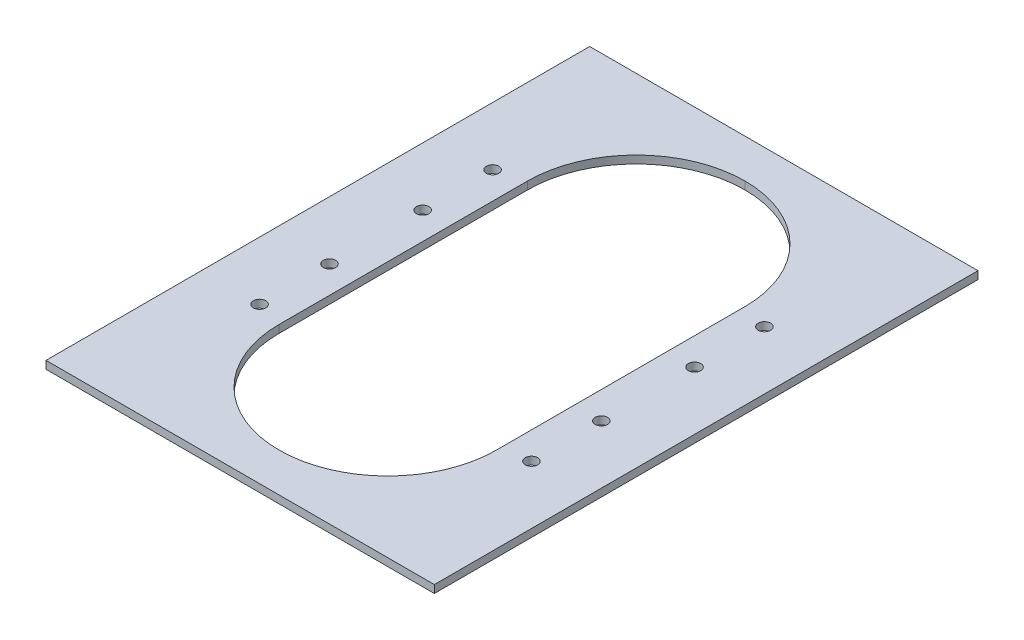
ISO-10303-21;
HEADER;
FILE_DESCRIPTION(('STEP AP214'),'2;1');
FILE_NAME('part.step','',(''),(''),'','','');
FILE_SCHEMA(('AUTOMOTIVE_DESIGN { 1 0 10303 214 1 1 1 1 }'));
ENDSEC;
DATA;
#1=APPLICATION_CONTEXT('core data for automotive mechanical design processes');
#2=APPLICATION_PROTOCOL_DEFINITION('international standard','automotive_design',2000,#1);
#3=PRODUCT_CONTEXT('',#1,'mechanical');
#4=PRODUCT('Part','Part','',(#3));
#5=PRODUCT_RELATED_PRODUCT_CATEGORY('part','',(#4));
#6=PRODUCT_DEFINITION_FORMATION('','',#4);
#7=PRODUCT_DEFINITION_CONTEXT('part definition',#1,'design');
#8=PRODUCT_DEFINITION('design','',#6,#7);
#9=PRODUCT_DEFINITION_SHAPE('','',#8);
#10=(LENGTH_UNIT() NAMED_UNIT(*) SI_UNIT(.MILLI.,.METRE.));
#11=(NAMED_UNIT(*) PLANE_ANGLE_UNIT() SI_UNIT($,.RADIAN.));
#12=(NAMED_UNIT(*) SI_UNIT($,.STERADIAN.) SOLID_ANGLE_UNIT());
#13=UNCERTAINTY_MEASURE_WITH_UNIT(LENGTH_MEASURE(1.E-05),#10,'distance_accuracy_value','');
#14=(GEOMETRIC_REPRESENTATION_CONTEXT(3) GLOBAL_UNCERTAINTY_ASSIGNED_CONTEXT((#13)) GLOBAL_UNIT_ASSIGNED_CONTEXT((#10,
#11,#12)) REPRESENTATION_CONTEXT('',''));
#15=CARTESIAN_POINT('',(0.,0.,0.));
#16=DIRECTION('',(0.,0.,1.));
#17=DIRECTION('',(1.,0.,0.));
#18=AXIS2_PLACEMENT_3D('',#15,#16,#17);
#19=CARTESIAN_POINT('',(0.,2.,0.));
#20=DIRECTION('',(0.,-1.,0.));
#21=DIRECTION('',(0.,0.,-1.));
#22=AXIS2_PLACEMENT_3D('',#19,#20,#21);
#23=PLANE('',#22);
#24=DIRECTION('',(0.,0.,-1.));
#25=VECTOR('',#24,1.);
#26=CARTESIAN_POINT('',(50.,2.,70.));
#27=LINE('',#26,#25);
#28=CARTESIAN_POINT('',(50.,2.,70.));
#29=VERTEX_POINT('',#28);
#30=CARTESIAN_POINT('',(50.,2.,-70.));
#31=VERTEX_POINT('',#30);
#32=EDGE_CURVE('E124',#29,#31,#27,.T.);
#33=ORIENTED_EDGE('',*,*,#32,.T.);
#34=DIRECTION('',(-1.,0.,0.));
#35=VECTOR('',#34,1.);
#36=CARTESIAN_POINT('',(-50.,2.,-70.));
#37=LINE('',#36,#35);
#38=CARTESIAN_POINT('',(-50.,2.,-70.));
#39=VERTEX_POINT('',#38);
#40=EDGE_CURVE('E113',#31,#39,#37,.T.);
#41=ORIENTED_EDGE('',*,*,#40,.T.);
#42=DIRECTION('',(0.,0.,1.));
#43=VECTOR('',#42,1.);
#44=CARTESIAN_POINT('',(-50.,2.,70.));
#45=LINE('',#44,#43);
#46=CARTESIAN_POINT('',(-50.,2.,70.));
#47=VERTEX_POINT('',#46);
#48=EDGE_CURVE('E123',#39,#47,#45,.T.);
#49=ORIENTED_EDGE('',*,*,#48,.T.);
#50=DIRECTION('',(1.,0.,0.));
#51=VECTOR('',#50,1.);
#52=CARTESIAN_POINT('',(-50.,2.,70.));
#53=LINE('',#52,#51);
#54=EDGE_CURVE('E128',#47,#29,#53,.T.);
#55=ORIENTED_EDGE('',*,*,#54,.T.);
#56=EDGE_LOOP('',(#33,#41,#49,#55));
#57=FACE_BOUND('',#56,.T.);
#58=DIRECTION('',(0.,0.,1.));
#59=VECTOR('',#58,1.);
#60=CARTESIAN_POINT('',(-28.,2.,-60.));
#61=LINE('',#60,#59);
#62=CARTESIAN_POINT('',(-28.,2.,-31.9999999999997));
#63=VERTEX_POINT('',#62);
#64=CARTESIAN_POINT('',(-28.,2.,31.9999999999997));
#65=VERTEX_POINT('',#64);
#66=EDGE_CURVE('E191',#63,#65,#61,.T.);
#67=ORIENTED_EDGE('',*,*,#66,.F.);
#68=CARTESIAN_POINT('',(2.74086309204336E-13,2.,-31.9999999999997));
#69=DIRECTION('',(0.,-1.,0.));
#70=DIRECTION('',(0.,0.,-1.));
#71=AXIS2_PLACEMENT_3D('',#68,#69,#70);
#72=CIRCLE('',#71,28.0000000000003);
#73=CARTESIAN_POINT('',(-2.74086309204336E-13,2.,-60.));
#74=VERTEX_POINT('',#73);
#75=EDGE_CURVE('E11',#63,#74,#72,.T.);
#76=ORIENTED_EDGE('',*,*,#75,.T.);
#77=CARTESIAN_POINT('',(-2.74086309204336E-13,2.,-31.9999999999997));
#78=DIRECTION('',(0.,-1.,0.));
#79=DIRECTION('',(0.,0.,-1.));
#80=AXIS2_PLACEMENT_3D('',#77,#78,#79);
#81=CIRCLE('',#80,28.0000000000003);
#82=CARTESIAN_POINT('',(28.,2.,-31.9999999999997));
#83=VERTEX_POINT('',#82);
#84=EDGE_CURVE('E161',#74,#83,#81,.T.);
#85=ORIENTED_EDGE('',*,*,#84,.T.);
#86=DIRECTION('',(0.,0.,-1.));
#87=VECTOR('',#86,1.);
#88=CARTESIAN_POINT('',(28.,2.,-60.));
#89=LINE('',#88,#87);
#90=CARTESIAN_POINT('',(28.,2.,31.9999999999997));
#91=VERTEX_POINT('',#90);
#92=EDGE_CURVE('E197',#91,#83,#89,.T.);
#93=ORIENTED_EDGE('',*,*,#92,.F.);
#94=CARTESIAN_POINT('',(-2.74086309204336E-13,2.,31.9999999999997));
#95=DIRECTION('',(0.,-1.,0.));
#96=DIRECTION('',(0.,0.,-1.));
#97=AXIS2_PLACEMENT_3D('',#94,#95,#96);
#98=CIRCLE('',#97,28.0000000000003);
#99=CARTESIAN_POINT('',(2.74086309204336E-13,2.,60.));
#100=VERTEX_POINT('',#99);
#101=EDGE_CURVE('E158',#91,#100,#98,.T.);
#102=ORIENTED_EDGE('',*,*,#101,.T.);
#103=CARTESIAN_POINT('',(2.74086309204336E-13,2.,31.9999999999997));
#104=DIRECTION('',(0.,-1.,0.));
#105=DIRECTION('',(0.,0.,-1.));
#106=AXIS2_PLACEMENT_3D('',#103,#104,#105);
#107=CIRCLE('',#106,28.0000000000003);
#108=EDGE_CURVE('E154',#100,#65,#107,.T.);
#109=ORIENTED_EDGE('',*,*,#108,.T.);
#110=EDGE_LOOP('',(#67,#76,#85,#93,#102,#109));
#111=FACE_BOUND('',#110,.T.);
#112=CARTESIAN_POINT('',(35.,2.,-30.));
#113=DIRECTION('',(0.,1.,0.));
#114=DIRECTION('',(0.,0.,-1.));
#115=AXIS2_PLACEMENT_3D('',#112,#113,#114);
#116=CIRCLE('',#115,1.6);
#117=CARTESIAN_POINT('',(35.,2.,-31.6));
#118=VERTEX_POINT('',#117);
#119=EDGE_CURVE('E189',#118,#118,#116,.T.);
#120=ORIENTED_EDGE('',*,*,#119,.F.);
#121=EDGE_LOOP('',(#120));
#122=FACE_BOUND('',#121,.T.);
#123=CARTESIAN_POINT('',(-35.,2.,-12.));
#124=DIRECTION('',(0.,1.,0.));
#125=DIRECTION('',(0.,0.,1.));
#126=AXIS2_PLACEMENT_3D('',#123,#124,#125);
#127=CIRCLE('',#126,1.6);
#128=CARTESIAN_POINT('',(-35.,2.,-10.4));
#129=VERTEX_POINT('',#128);
#130=EDGE_CURVE('E317',#129,#129,#127,.T.);
#131=ORIENTED_EDGE('',*,*,#130,.F.);
#132=EDGE_LOOP('',(#131));
#133=FACE_BOUND('',#132,.T.);
#134=CARTESIAN_POINT('',(-35.,2.,-30.));
#135=DIRECTION('',(0.,1.,0.));
#136=DIRECTION('',(0.,0.,1.));
#137=AXIS2_PLACEMENT_3D('',#134,#135,#136);
#138=CIRCLE('',#137,1.6);
#139=CARTESIAN_POINT('',(-35.,2.,-28.4));
#140=VERTEX_POINT('',#139);
#141=EDGE_CURVE('E311',#140,#140,#138,.T.);
#142=ORIENTED_EDGE('',*,*,#141,.F.);
#143=EDGE_LOOP('',(#142));
#144=FACE_BOUND('',#143,.T.);
#145=CARTESIAN_POINT('',(35.,2.,-12.));
#146=DIRECTION('',(0.,1.,0.));
#147=DIRECTION('',(0.,0.,-1.));
#148=AXIS2_PLACEMENT_3D('',#145,#146,#147);
#149=CIRCLE('',#148,1.6);
#150=CARTESIAN_POINT('',(35.,2.,-13.6));
#151=VERTEX_POINT('',#150);
#152=EDGE_CURVE('E305',#151,#151,#149,.T.);
#153=ORIENTED_EDGE('',*,*,#152,.F.);
#154=EDGE_LOOP('',(#153));
#155=FACE_BOUND('',#154,.T.);
#156=CARTESIAN_POINT('',(35.,2.,12.));
#157=DIRECTION('',(0.,1.,0.));
#158=DIRECTION('',(0.,0.,1.));
#159=AXIS2_PLACEMENT_3D('',#156,#157,#158);
#160=CIRCLE('',#159,1.6);
#161=CARTESIAN_POINT('',(35.,2.,13.6));
#162=VERTEX_POINT('',#161);
#163=EDGE_CURVE('E299',#162,#162,#160,.T.);
#164=ORIENTED_EDGE('',*,*,#163,.F.);
#165=EDGE_LOOP('',(#164));
#166=FACE_BOUND('',#165,.T.);
#167=CARTESIAN_POINT('',(35.,2.,30.));
#168=DIRECTION('',(0.,1.,0.));
#169=DIRECTION('',(0.,0.,1.));
#170=AXIS2_PLACEMENT_3D('',#167,#168,#169);
#171=CIRCLE('',#170,1.6);
#172=CARTESIAN_POINT('',(35.,2.,31.6));
#173=VERTEX_POINT('',#172);
#174=EDGE_CURVE('E293',#173,#173,#171,.T.);
#175=ORIENTED_EDGE('',*,*,#174,.F.);
#176=EDGE_LOOP('',(#175));
#177=FACE_BOUND('',#176,.T.);
#178=CARTESIAN_POINT('',(-35.,2.,30.));
#179=DIRECTION('',(0.,1.,0.));
#180=DIRECTION('',(0.,0.,-1.));
#181=AXIS2_PLACEMENT_3D('',#178,#179,#180);
#182=CIRCLE('',#181,1.6);
#183=CARTESIAN_POINT('',(-35.,2.,28.4));
#184=VERTEX_POINT('',#183);
#185=EDGE_CURVE('E287',#184,#184,#182,.T.);
#186=ORIENTED_EDGE('',*,*,#185,.F.);
#187=EDGE_LOOP('',(#186));
#188=FACE_BOUND('',#187,.T.);
#189=CARTESIAN_POINT('',(-35.,2.,12.));
#190=DIRECTION('',(0.,1.,0.));
#191=DIRECTION('',(0.,0.,-1.));
#192=AXIS2_PLACEMENT_3D('',#189,#190,#191);
#193=CIRCLE('',#192,1.6);
#194=CARTESIAN_POINT('',(-35.,2.,10.4));
#195=VERTEX_POINT('',#194);
#196=EDGE_CURVE('E170',#195,#195,#193,.T.);
#197=ORIENTED_EDGE('',*,*,#196,.F.);
#198=EDGE_LOOP('',(#197));
#199=FACE_BOUND('',#198,.T.);
#200=ADVANCED_FACE('F35',(#57,#111,#122,#133,#144,#155,#166,#177,#188,#199),#23,.F.);
#201=CARTESIAN_POINT('',(0.,0.,0.));
#202=DIRECTION('',(0.,-1.,0.));
#203=DIRECTION('',(0.,0.,-1.));
#204=AXIS2_PLACEMENT_3D('',#201,#202,#203);
#205=PLANE('',#204);
#206=CARTESIAN_POINT('',(-35.,0.,30.));
#207=DIRECTION('',(0.,1.,0.));
#208=DIRECTION('',(0.,0.,-1.));
#209=AXIS2_PLACEMENT_3D('',#206,#207,#208);
#210=CIRCLE('',#209,1.6);
#211=CARTESIAN_POINT('',(-35.,0.,28.4));
#212=VERTEX_POINT('',#211);
#213=EDGE_CURVE('E284',#212,#212,#210,.T.);
#214=ORIENTED_EDGE('',*,*,#213,.T.);
#215=EDGE_LOOP('',(#214));
#216=FACE_BOUND('',#215,.T.);
#217=CARTESIAN_POINT('',(35.,0.,12.));
#218=DIRECTION('',(0.,1.,0.));
#219=DIRECTION('',(0.,0.,1.));
#220=AXIS2_PLACEMENT_3D('',#217,#218,#219);
#221=CIRCLE('',#220,1.6);
#222=CARTESIAN_POINT('',(35.,0.,13.6));
#223=VERTEX_POINT('',#222);
#224=EDGE_CURVE('E296',#223,#223,#221,.T.);
#225=ORIENTED_EDGE('',*,*,#224,.T.);
#226=EDGE_LOOP('',(#225));
#227=FACE_BOUND('',#226,.T.);
#228=CARTESIAN_POINT('',(-35.,0.,-30.));
#229=DIRECTION('',(0.,1.,0.));
#230=DIRECTION('',(0.,0.,1.));
#231=AXIS2_PLACEMENT_3D('',#228,#229,#230);
#232=CIRCLE('',#231,1.6);
#233=CARTESIAN_POINT('',(-35.,0.,-28.4));
#234=VERTEX_POINT('',#233);
#235=EDGE_CURVE('E308',#234,#234,#232,.T.);
#236=ORIENTED_EDGE('',*,*,#235,.T.);
#237=EDGE_LOOP('',(#236));
#238=FACE_BOUND('',#237,.T.);
#239=CARTESIAN_POINT('',(35.,0.,-30.));
#240=DIRECTION('',(0.,1.,0.));
#241=DIRECTION('',(0.,0.,-1.));
#242=AXIS2_PLACEMENT_3D('',#239,#240,#241);
#243=CIRCLE('',#242,1.6);
#244=CARTESIAN_POINT('',(35.,0.,-31.6));
#245=VERTEX_POINT('',#244);
#246=EDGE_CURVE('E194',#245,#245,#243,.T.);
#247=ORIENTED_EDGE('',*,*,#246,.T.);
#248=EDGE_LOOP('',(#247));
#249=FACE_BOUND('',#248,.T.);
#250=DIRECTION('',(0.,0.,-1.));
#251=VECTOR('',#250,1.);
#252=CARTESIAN_POINT('',(50.,0.,70.));
#253=LINE('',#252,#251);
#254=CARTESIAN_POINT('',(50.,0.,70.));
#255=VERTEX_POINT('',#254);
#256=CARTESIAN_POINT('',(50.,0.,-70.));
#257=VERTEX_POINT('',#256);
#258=EDGE_CURVE('E136',#255,#257,#253,.T.);
#259=ORIENTED_EDGE('',*,*,#258,.F.);
#260=DIRECTION('',(1.,0.,0.));
#261=VECTOR('',#260,1.);
#262=CARTESIAN_POINT('',(-50.,0.,70.));
#263=LINE('',#262,#261);
#264=CARTESIAN_POINT('',(-50.,0.,70.));
#265=VERTEX_POINT('',#264);
#266=EDGE_CURVE('E132',#265,#255,#263,.T.);
#267=ORIENTED_EDGE('',*,*,#266,.F.);
#268=DIRECTION('',(0.,0.,1.));
#269=VECTOR('',#268,1.);
#270=CARTESIAN_POINT('',(-50.,0.,70.));
#271=LINE('',#270,#269);
#272=CARTESIAN_POINT('',(-50.,0.,-70.));
#273=VERTEX_POINT('',#272);
#274=EDGE_CURVE('E206',#273,#265,#271,.T.);
#275=ORIENTED_EDGE('',*,*,#274,.F.);
#276=DIRECTION('',(-1.,0.,0.));
#277=VECTOR('',#276,1.);
#278=CARTESIAN_POINT('',(-50.,0.,-70.));
#279=LINE('',#278,#277);
#280=EDGE_CURVE('E204',#257,#273,#279,.T.);
#281=ORIENTED_EDGE('',*,*,#280,.F.);
#282=EDGE_LOOP('',(#259,#267,#275,#281));
#283=FACE_BOUND('',#282,.T.);
#284=CARTESIAN_POINT('',(-2.74086309204336E-13,0.,-31.9999999999997));
#285=DIRECTION('',(0.,-1.,0.));
#286=DIRECTION('',(0.,0.,-1.));
#287=AXIS2_PLACEMENT_3D('',#284,#285,#286);
#288=CIRCLE('',#287,28.0000000000003);
#289=CARTESIAN_POINT('',(28.,0.,-31.9999999999997));
#290=VERTEX_POINT('',#289);
#291=CARTESIAN_POINT('',(-2.74086309204336E-13,0.,-60.));
#292=VERTEX_POINT('',#291);
#293=EDGE_CURVE('E58',#290,#292,#288,.F.);
#294=ORIENTED_EDGE('',*,*,#293,.T.);
#295=CARTESIAN_POINT('',(2.74086309204336E-13,0.,-31.9999999999997));
#296=DIRECTION('',(0.,-1.,0.));
#297=DIRECTION('',(0.,0.,-1.));
#298=AXIS2_PLACEMENT_3D('',#295,#296,#297);
#299=CIRCLE('',#298,28.0000000000003);
#300=CARTESIAN_POINT('',(-28.,0.,-31.9999999999997));
#301=VERTEX_POINT('',#300);
#302=EDGE_CURVE('E44',#292,#301,#299,.F.);
#303=ORIENTED_EDGE('',*,*,#302,.T.);
#304=DIRECTION('',(0.,0.,1.));
#305=VECTOR('',#304,1.);
#306=CARTESIAN_POINT('',(-28.,0.,-60.));
#307=LINE('',#306,#305);
#308=CARTESIAN_POINT('',(-28.,0.,31.9999999999997));
#309=VERTEX_POINT('',#308);
#310=EDGE_CURVE('E183',#301,#309,#307,.T.);
#311=ORIENTED_EDGE('',*,*,#310,.T.);
#312=CARTESIAN_POINT('',(2.74086309204336E-13,0.,31.9999999999997));
#313=DIRECTION('',(0.,-1.,0.));
#314=DIRECTION('',(0.,0.,-1.));
#315=AXIS2_PLACEMENT_3D('',#312,#313,#314);
#316=CIRCLE('',#315,28.0000000000003);
#317=CARTESIAN_POINT('',(2.74086309204336E-13,0.,60.));
#318=VERTEX_POINT('',#317);
#319=EDGE_CURVE('E152',#309,#318,#316,.F.);
#320=ORIENTED_EDGE('',*,*,#319,.T.);
#321=CARTESIAN_POINT('',(-2.74086309204336E-13,0.,31.9999999999997));
#322=DIRECTION('',(0.,-1.,0.));
#323=DIRECTION('',(0.,0.,-1.));
#324=AXIS2_PLACEMENT_3D('',#321,#322,#323);
#325=CIRCLE('',#324,28.0000000000003);
#326=CARTESIAN_POINT('',(28.,0.,31.9999999999997));
#327=VERTEX_POINT('',#326);
#328=EDGE_CURVE('E156',#318,#327,#325,.F.);
#329=ORIENTED_EDGE('',*,*,#328,.T.);
#330=DIRECTION('',(0.,0.,-1.));
#331=VECTOR('',#330,1.);
#332=CARTESIAN_POINT('',(28.,0.,-60.));
#333=LINE('',#332,#331);
#334=EDGE_CURVE('E188',#327,#290,#333,.T.);
#335=ORIENTED_EDGE('',*,*,#334,.T.);
#336=EDGE_LOOP('',(#294,#303,#311,#320,#329,#335));
#337=FACE_BOUND('',#336,.T.);
#338=CARTESIAN_POINT('',(-35.,0.,-12.));
#339=DIRECTION('',(0.,1.,0.));
#340=DIRECTION('',(0.,0.,1.));
#341=AXIS2_PLACEMENT_3D('',#338,#339,#340);
#342=CIRCLE('',#341,1.6);
#343=CARTESIAN_POINT('',(-35.,0.,-10.4));
#344=VERTEX_POINT('',#343);
#345=EDGE_CURVE('E314',#344,#344,#342,.T.);
#346=ORIENTED_EDGE('',*,*,#345,.T.);
#347=EDGE_LOOP('',(#346));
#348=FACE_BOUND('',#347,.T.);
#349=CARTESIAN_POINT('',(35.,0.,-12.));
#350=DIRECTION('',(0.,1.,0.));
#351=DIRECTION('',(0.,0.,-1.));
#352=AXIS2_PLACEMENT_3D('',#349,#350,#351);
#353=CIRCLE('',#352,1.6);
#354=CARTESIAN_POINT('',(35.,0.,-13.6));
#355=VERTEX_POINT('',#354);
#356=EDGE_CURVE('E302',#355,#355,#353,.T.);
#357=ORIENTED_EDGE('',*,*,#356,.T.);
#358=EDGE_LOOP('',(#357));
#359=FACE_BOUND('',#358,.T.);
#360=CARTESIAN_POINT('',(35.,0.,30.));
#361=DIRECTION('',(0.,1.,0.));
#362=DIRECTION('',(0.,0.,1.));
#363=AXIS2_PLACEMENT_3D('',#360,#361,#362);
#364=CIRCLE('',#363,1.6);
#365=CARTESIAN_POINT('',(35.,0.,31.6));
#366=VERTEX_POINT('',#365);
#367=EDGE_CURVE('E291',#366,#366,#364,.T.);
#368=ORIENTED_EDGE('',*,*,#367,.T.);
#369=EDGE_LOOP('',(#368));
#370=FACE_BOUND('',#369,.T.);
#371=CARTESIAN_POINT('',(-35.,0.,12.));
#372=DIRECTION('',(0.,1.,0.));
#373=DIRECTION('',(0.,0.,-1.));
#374=AXIS2_PLACEMENT_3D('',#371,#372,#373);
#375=CIRCLE('',#374,1.6);
#376=CARTESIAN_POINT('',(-35.,0.,10.4));
#377=VERTEX_POINT('',#376);
#378=EDGE_CURVE('E165',#377,#377,#375,.T.);
#379=ORIENTED_EDGE('',*,*,#378,.T.);
#380=EDGE_LOOP('',(#379));
#381=FACE_BOUND('',#380,.T.);
#382=ADVANCED_FACE('F181',(#216,#227,#238,#249,#283,#337,#348,#359,#370,#381),#205,.T.);
#383=CARTESIAN_POINT('',(50.,2.,70.));
#384=DIRECTION('',(-1.,0.,0.));
#385=DIRECTION('',(0.,0.,1.));
#386=AXIS2_PLACEMENT_3D('',#383,#384,#385);
#387=PLANE('',#386);
#388=ORIENTED_EDGE('',*,*,#258,.T.);
#389=DIRECTION('',(0.,-1.,0.));
#390=VECTOR('',#389,1.);
#391=CARTESIAN_POINT('',(50.,2.,-70.));
#392=LINE('',#391,#390);
#393=EDGE_CURVE('E117',#31,#257,#392,.T.);
#394=ORIENTED_EDGE('',*,*,#393,.F.);
#395=ORIENTED_EDGE('',*,*,#32,.F.);
#396=DIRECTION('',(0.,-1.,0.));
#397=VECTOR('',#396,1.);
#398=CARTESIAN_POINT('',(50.,2.,70.));
#399=LINE('',#398,#397);
#400=EDGE_CURVE('E202',#29,#255,#399,.T.);
#401=ORIENTED_EDGE('',*,*,#400,.T.);
#402=EDGE_LOOP('',(#388,#394,#395,#401));
#403=FACE_BOUND('',#402,.T.);
#404=ADVANCED_FACE('F134',(#403),#387,.F.);
#405=CARTESIAN_POINT('',(-50.,2.,-70.));
#406=DIRECTION('',(0.,0.,1.));
#407=DIRECTION('',(1.,0.,0.));
#408=AXIS2_PLACEMENT_3D('',#405,#406,#407);
#409=PLANE('',#408);
#410=ORIENTED_EDGE('',*,*,#280,.T.);
#411=DIRECTION('',(0.,-1.,0.));
#412=VECTOR('',#411,1.);
#413=CARTESIAN_POINT('',(-50.,2.,-70.));
#414=LINE('',#413,#412);
#415=EDGE_CURVE('E120',#39,#273,#414,.T.);
#416=ORIENTED_EDGE('',*,*,#415,.F.);
#417=ORIENTED_EDGE('',*,*,#40,.F.);
#418=ORIENTED_EDGE('',*,*,#393,.T.);
#419=EDGE_LOOP('',(#410,#416,#417,#418));
#420=FACE_BOUND('',#419,.T.);
#421=ADVANCED_FACE('F115',(#420),#409,.F.);
#422=CARTESIAN_POINT('',(-50.,2.,70.));
#423=DIRECTION('',(1.,0.,0.));
#424=DIRECTION('',(0.,0.,-1.));
#425=AXIS2_PLACEMENT_3D('',#422,#423,#424);
#426=PLANE('',#425);
#427=ORIENTED_EDGE('',*,*,#274,.T.);
#428=DIRECTION('',(0.,-1.,0.));
#429=VECTOR('',#428,1.);
#430=CARTESIAN_POINT('',(-50.,2.,70.));
#431=LINE('',#430,#429);
#432=EDGE_CURVE('E141',#47,#265,#431,.T.);
#433=ORIENTED_EDGE('',*,*,#432,.F.);
#434=ORIENTED_EDGE('',*,*,#48,.F.);
#435=ORIENTED_EDGE('',*,*,#415,.T.);
#436=EDGE_LOOP('',(#427,#433,#434,#435));
#437=FACE_BOUND('',#436,.T.);
#438=ADVANCED_FACE('F217',(#437),#426,.F.);
#439=CARTESIAN_POINT('',(-50.,2.,70.));
#440=DIRECTION('',(0.,0.,-1.));
#441=DIRECTION('',(-1.,0.,0.));
#442=AXIS2_PLACEMENT_3D('',#439,#440,#441);
#443=PLANE('',#442);
#444=ORIENTED_EDGE('',*,*,#266,.T.);
#445=ORIENTED_EDGE('',*,*,#400,.F.);
#446=ORIENTED_EDGE('',*,*,#54,.F.);
#447=ORIENTED_EDGE('',*,*,#432,.T.);
#448=EDGE_LOOP('',(#444,#445,#446,#447));
#449=FACE_BOUND('',#448,.T.);
#450=ADVANCED_FACE('F213',(#449),#443,.F.);
#451=CARTESIAN_POINT('',(-28.,2.,-60.));
#452=DIRECTION('',(1.,0.,0.));
#453=DIRECTION('',(0.,0.,-1.));
#454=AXIS2_PLACEMENT_3D('',#451,#452,#453);
#455=PLANE('',#454);
#456=ORIENTED_EDGE('',*,*,#66,.T.);
#457=DIRECTION('',(0.,-1.,0.));
#458=VECTOR('',#457,1.);
#459=CARTESIAN_POINT('',(-28.,0.,31.9999999999997));
#460=LINE('',#459,#458);
#461=EDGE_CURVE('E139',#65,#309,#460,.T.);
#462=ORIENTED_EDGE('',*,*,#461,.T.);
#463=ORIENTED_EDGE('',*,*,#310,.F.);
#464=DIRECTION('',(0.,-1.,0.));
#465=VECTOR('',#464,1.);
#466=CARTESIAN_POINT('',(-28.,2.,-31.9999999999997));
#467=LINE('',#466,#465);
#468=EDGE_CURVE('E137',#301,#63,#467,.F.);
#469=ORIENTED_EDGE('',*,*,#468,.T.);
#470=EDGE_LOOP('',(#456,#462,#463,#469));
#471=FACE_BOUND('',#470,.T.);
#472=ADVANCED_FACE('F186',(#471),#455,.T.);
#473=CARTESIAN_POINT('',(28.,2.,-60.));
#474=DIRECTION('',(-1.,0.,0.));
#475=DIRECTION('',(0.,0.,1.));
#476=AXIS2_PLACEMENT_3D('',#473,#474,#475);
#477=PLANE('',#476);
#478=ORIENTED_EDGE('',*,*,#334,.F.);
#479=DIRECTION('',(0.,-1.,0.));
#480=VECTOR('',#479,1.);
#481=CARTESIAN_POINT('',(28.,2.,31.9999999999997));
#482=LINE('',#481,#480);
#483=EDGE_CURVE('E150',#327,#91,#482,.F.);
#484=ORIENTED_EDGE('',*,*,#483,.T.);
#485=ORIENTED_EDGE('',*,*,#92,.T.);
#486=DIRECTION('',(0.,-1.,0.));
#487=VECTOR('',#486,1.);
#488=CARTESIAN_POINT('',(28.,0.,-31.9999999999997));
#489=LINE('',#488,#487);
#490=EDGE_CURVE('E147',#83,#290,#489,.T.);
#491=ORIENTED_EDGE('',*,*,#490,.T.);
#492=EDGE_LOOP('',(#478,#484,#485,#491));
#493=FACE_BOUND('',#492,.T.);
#494=ADVANCED_FACE('F236',(#493),#477,.T.);
#495=CARTESIAN_POINT('',(35.,2.,-30.));
#496=DIRECTION('',(0.,-1.,0.));
#497=DIRECTION('',(0.,0.,-1.));
#498=AXIS2_PLACEMENT_3D('',#495,#496,#497);
#499=CYLINDRICAL_SURFACE('',#498,1.6);
#500=ORIENTED_EDGE('',*,*,#119,.T.);
#501=EDGE_LOOP('',(#500));
#502=FACE_BOUND('',#501,.T.);
#503=ORIENTED_EDGE('',*,*,#246,.F.);
#504=EDGE_LOOP('',(#503));
#505=FACE_BOUND('',#504,.T.);
#506=ADVANCED_FACE('F239',(#502,#505),#499,.F.);
#507=CARTESIAN_POINT('',(-35.,2.,-12.));
#508=DIRECTION('',(0.,-1.,0.));
#509=DIRECTION('',(0.,0.,-1.));
#510=AXIS2_PLACEMENT_3D('',#507,#508,#509);
#511=CYLINDRICAL_SURFACE('',#510,1.6);
#512=ORIENTED_EDGE('',*,*,#130,.T.);
#513=EDGE_LOOP('',(#512));
#514=FACE_BOUND('',#513,.T.);
#515=ORIENTED_EDGE('',*,*,#345,.F.);
#516=EDGE_LOOP('',(#515));
#517=FACE_BOUND('',#516,.T.);
#518=ADVANCED_FACE('F243',(#514,#517),#511,.F.);
#519=CARTESIAN_POINT('',(-35.,2.,-30.));
#520=DIRECTION('',(0.,-1.,0.));
#521=DIRECTION('',(0.,0.,-1.));
#522=AXIS2_PLACEMENT_3D('',#519,#520,#521);
#523=CYLINDRICAL_SURFACE('',#522,1.6);
#524=ORIENTED_EDGE('',*,*,#141,.T.);
#525=EDGE_LOOP('',(#524));
#526=FACE_BOUND('',#525,.T.);
#527=ORIENTED_EDGE('',*,*,#235,.F.);
#528=EDGE_LOOP('',(#527));
#529=FACE_BOUND('',#528,.T.);
#530=ADVANCED_FACE('F247',(#526,#529),#523,.F.);
#531=CARTESIAN_POINT('',(35.,2.,-12.));
#532=DIRECTION('',(0.,-1.,0.));
#533=DIRECTION('',(0.,0.,-1.));
#534=AXIS2_PLACEMENT_3D('',#531,#532,#533);
#535=CYLINDRICAL_SURFACE('',#534,1.6);
#536=ORIENTED_EDGE('',*,*,#152,.T.);
#537=EDGE_LOOP('',(#536));
#538=FACE_BOUND('',#537,.T.);
#539=ORIENTED_EDGE('',*,*,#356,.F.);
#540=EDGE_LOOP('',(#539));
#541=FACE_BOUND('',#540,.T.);
#542=ADVANCED_FACE('F251',(#538,#541),#535,.F.);
#543=CARTESIAN_POINT('',(35.,2.,12.));
#544=DIRECTION('',(0.,-1.,0.));
#545=DIRECTION('',(0.,0.,-1.));
#546=AXIS2_PLACEMENT_3D('',#543,#544,#545);
#547=CYLINDRICAL_SURFACE('',#546,1.6);
#548=ORIENTED_EDGE('',*,*,#163,.T.);
#549=EDGE_LOOP('',(#548));
#550=FACE_BOUND('',#549,.T.);
#551=ORIENTED_EDGE('',*,*,#224,.F.);
#552=EDGE_LOOP('',(#551));
#553=FACE_BOUND('',#552,.T.);
#554=ADVANCED_FACE('F255',(#550,#553),#547,.F.);
#555=CARTESIAN_POINT('',(35.,2.,30.));
#556=DIRECTION('',(0.,-1.,0.));
#557=DIRECTION('',(0.,0.,-1.));
#558=AXIS2_PLACEMENT_3D('',#555,#556,#557);
#559=CYLINDRICAL_SURFACE('',#558,1.6);
#560=ORIENTED_EDGE('',*,*,#174,.T.);
#561=EDGE_LOOP('',(#560));
#562=FACE_BOUND('',#561,.T.);
#563=ORIENTED_EDGE('',*,*,#367,.F.);
#564=EDGE_LOOP('',(#563));
#565=FACE_BOUND('',#564,.T.);
#566=ADVANCED_FACE('F259',(#562,#565),#559,.F.);
#567=CARTESIAN_POINT('',(-35.,2.,30.));
#568=DIRECTION('',(0.,-1.,0.));
#569=DIRECTION('',(0.,0.,-1.));
#570=AXIS2_PLACEMENT_3D('',#567,#568,#569);
#571=CYLINDRICAL_SURFACE('',#570,1.6);
#572=ORIENTED_EDGE('',*,*,#185,.T.);
#573=EDGE_LOOP('',(#572));
#574=FACE_BOUND('',#573,.T.);
#575=ORIENTED_EDGE('',*,*,#213,.F.);
#576=EDGE_LOOP('',(#575));
#577=FACE_BOUND('',#576,.T.);
#578=ADVANCED_FACE('F263',(#574,#577),#571,.F.);
#579=CARTESIAN_POINT('',(-35.,2.,12.));
#580=DIRECTION('',(0.,-1.,0.));
#581=DIRECTION('',(0.,0.,-1.));
#582=AXIS2_PLACEMENT_3D('',#579,#580,#581);
#583=CYLINDRICAL_SURFACE('',#582,1.6);
#584=ORIENTED_EDGE('',*,*,#196,.T.);
#585=EDGE_LOOP('',(#584));
#586=FACE_BOUND('',#585,.T.);
#587=ORIENTED_EDGE('',*,*,#378,.F.);
#588=EDGE_LOOP('',(#587));
#589=FACE_BOUND('',#588,.T.);
#590=ADVANCED_FACE('F267',(#586,#589),#583,.F.);
#591=CARTESIAN_POINT('',(-2.74086309204336E-13,2.,31.9999999999997));
#592=DIRECTION('',(0.,1.,0.));
#593=DIRECTION('',(0.,0.,1.));
#594=AXIS2_PLACEMENT_3D('',#591,#592,#593);
#595=CYLINDRICAL_SURFACE('',#594,28.0000000000003);
#596=DIRECTION('',(0.,-1.,0.));
#597=VECTOR('',#596,1.);
#598=CARTESIAN_POINT('',(-2.74086309204336E-13,0.,60.));
#599=LINE('',#598,#597);
#600=EDGE_CURVE('E163',#100,#318,#599,.T.);
#601=ORIENTED_EDGE('',*,*,#600,.F.);
#602=ORIENTED_EDGE('',*,*,#101,.F.);
#603=ORIENTED_EDGE('',*,*,#483,.F.);
#604=ORIENTED_EDGE('',*,*,#328,.F.);
#605=EDGE_LOOP('',(#601,#602,#603,#604));
#606=FACE_BOUND('',#605,.T.);
#607=ADVANCED_FACE('F270',(#606),#595,.F.);
#608=CARTESIAN_POINT('',(2.74086309204336E-13,2.,31.9999999999997));
#609=DIRECTION('',(0.,1.,0.));
#610=DIRECTION('',(0.,0.,1.));
#611=AXIS2_PLACEMENT_3D('',#608,#609,#610);
#612=CYLINDRICAL_SURFACE('',#611,28.0000000000003);
#613=ORIENTED_EDGE('',*,*,#108,.F.);
#614=ORIENTED_EDGE('',*,*,#600,.T.);
#615=ORIENTED_EDGE('',*,*,#319,.F.);
#616=ORIENTED_EDGE('',*,*,#461,.F.);
#617=EDGE_LOOP('',(#613,#614,#615,#616));
#618=FACE_BOUND('',#617,.T.);
#619=ADVANCED_FACE('F275',(#618),#612,.F.);
#620=CARTESIAN_POINT('',(2.74086309204336E-13,2.,-31.9999999999997));
#621=DIRECTION('',(0.,1.,0.));
#622=DIRECTION('',(0.,0.,1.));
#623=AXIS2_PLACEMENT_3D('',#620,#621,#622);
#624=CYLINDRICAL_SURFACE('',#623,28.0000000000003);
#625=DIRECTION('',(0.,-1.,0.));
#626=VECTOR('',#625,1.);
#627=CARTESIAN_POINT('',(2.74086309204336E-13,0.,-60.));
#628=LINE('',#627,#626);
#629=EDGE_CURVE('E39',#74,#292,#628,.T.);
#630=ORIENTED_EDGE('',*,*,#629,.F.);
#631=ORIENTED_EDGE('',*,*,#75,.F.);
#632=ORIENTED_EDGE('',*,*,#468,.F.);
#633=ORIENTED_EDGE('',*,*,#302,.F.);
#634=EDGE_LOOP('',(#630,#631,#632,#633));
#635=FACE_BOUND('',#634,.T.);
#636=ADVANCED_FACE('F37',(#635),#624,.F.);
#637=CARTESIAN_POINT('',(-2.74086309204336E-13,2.,-31.9999999999997));
#638=DIRECTION('',(0.,1.,0.));
#639=DIRECTION('',(0.,0.,1.));
#640=AXIS2_PLACEMENT_3D('',#637,#638,#639);
#641=CYLINDRICAL_SURFACE('',#640,28.0000000000003);
#642=ORIENTED_EDGE('',*,*,#84,.F.);
#643=ORIENTED_EDGE('',*,*,#629,.T.);
#644=ORIENTED_EDGE('',*,*,#293,.F.);
#645=ORIENTED_EDGE('',*,*,#490,.F.);
#646=EDGE_LOOP('',(#642,#643,#644,#645));
#647=FACE_BOUND('',#646,.T.);
#648=ADVANCED_FACE('F175',(#647),#641,.F.);
#649=CLOSED_SHELL('',(#200,#382,#404,#421,#438,#450,#472,#494,#506,#518,#530,#542,#554,#566,
#578,#590,#607,#619,#636,#648));
#650=MANIFOLD_SOLID_BREP('B2',#649);
#651=ADVANCED_BREP_SHAPE_REPRESENTATION('',(#18,#650),#14);
#652=SHAPE_DEFINITION_REPRESENTATION(#9,#651);
ENDSEC;
END-ISO-10303-21;
